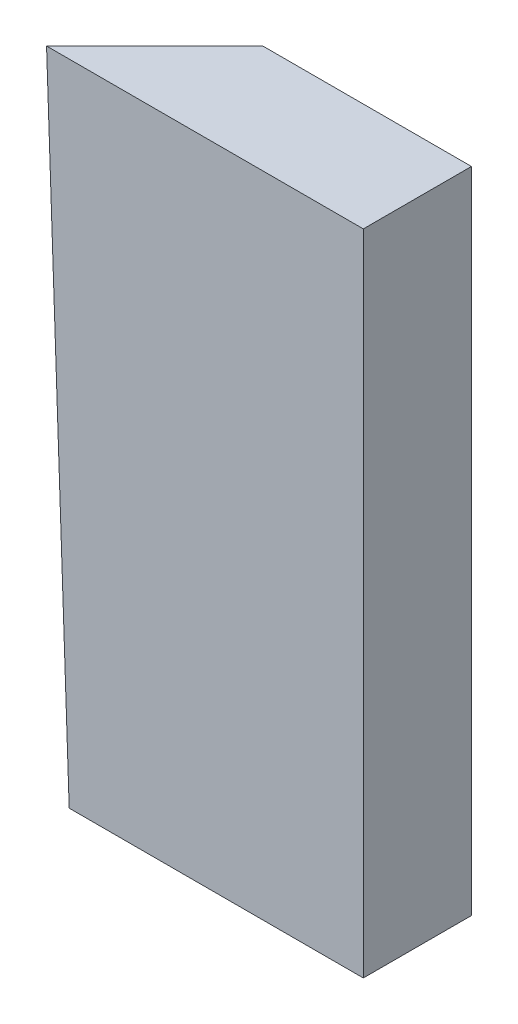
ISO-10303-21;
HEADER;
FILE_DESCRIPTION(('STEP AP214'),'2;1');
FILE_NAME('part.step','',(''),(''),'','','');
FILE_SCHEMA(('AUTOMOTIVE_DESIGN { 1 0 10303 214 1 1 1 1 }'));
ENDSEC;
DATA;
#1=APPLICATION_CONTEXT('core data for automotive mechanical design processes');
#2=APPLICATION_PROTOCOL_DEFINITION('international standard','automotive_design',2000,#1);
#3=PRODUCT_CONTEXT('',#1,'mechanical');
#4=PRODUCT('Part','Part','',(#3));
#5=PRODUCT_RELATED_PRODUCT_CATEGORY('part','',(#4));
#6=PRODUCT_DEFINITION_FORMATION('','',#4);
#7=PRODUCT_DEFINITION_CONTEXT('part definition',#1,'design');
#8=PRODUCT_DEFINITION('design','',#6,#7);
#9=PRODUCT_DEFINITION_SHAPE('','',#8);
#10=(LENGTH_UNIT() NAMED_UNIT(*) SI_UNIT(.MILLI.,.METRE.));
#11=(NAMED_UNIT(*) PLANE_ANGLE_UNIT() SI_UNIT($,.RADIAN.));
#12=(NAMED_UNIT(*) SI_UNIT($,.STERADIAN.) SOLID_ANGLE_UNIT());
#13=UNCERTAINTY_MEASURE_WITH_UNIT(LENGTH_MEASURE(1.E-05),#10,'distance_accuracy_value','');
#14=(GEOMETRIC_REPRESENTATION_CONTEXT(3) GLOBAL_UNCERTAINTY_ASSIGNED_CONTEXT((#13)) GLOBAL_UNIT_ASSIGNED_CONTEXT((#10,
#11,#12)) REPRESENTATION_CONTEXT('',''));
#15=CARTESIAN_POINT('',(0.,0.,0.));
#16=DIRECTION('',(0.,0.,1.));
#17=DIRECTION('',(1.,0.,0.));
#18=AXIS2_PLACEMENT_3D('',#15,#16,#17);
#19=CARTESIAN_POINT('',(0.,0.,0.));
#20=DIRECTION('',(0.,1.,0.));
#21=DIRECTION('',(0.,0.,1.));
#22=AXIS2_PLACEMENT_3D('',#19,#20,#21);
#23=PLANE('',#22);
#24=DIRECTION('',(-0.707106781186548,0.,0.707106781186547));
#25=VECTOR('',#24,1.);
#26=CARTESIAN_POINT('',(12.5,0.,-12.5));
#27=LINE('',#26,#25);
#28=CARTESIAN_POINT('',(12.5,0.,-12.5));
#29=VERTEX_POINT('',#28);
#30=CARTESIAN_POINT('',(0.,0.,0.));
#31=VERTEX_POINT('',#30);
#32=EDGE_CURVE('E167',#29,#31,#27,.T.);
#33=ORIENTED_EDGE('',*,*,#32,.F.);
#34=DIRECTION('',(-1.,0.,0.));
#35=VECTOR('',#34,1.);
#36=CARTESIAN_POINT('',(34.,0.,-12.5));
#37=LINE('',#36,#35);
#38=CARTESIAN_POINT('',(34.,0.,-12.5));
#39=VERTEX_POINT('',#38);
#40=EDGE_CURVE('E12',#39,#29,#37,.T.);
#41=ORIENTED_EDGE('',*,*,#40,.F.);
#42=DIRECTION('',(0.,0.,-1.));
#43=VECTOR('',#42,1.);
#44=CARTESIAN_POINT('',(34.,0.,0.));
#45=LINE('',#44,#43);
#46=CARTESIAN_POINT('',(34.,0.,0.));
#47=VERTEX_POINT('',#46);
#48=EDGE_CURVE('E61',#47,#39,#45,.T.);
#49=ORIENTED_EDGE('',*,*,#48,.F.);
#50=DIRECTION('',(1.,0.,0.));
#51=VECTOR('',#50,1.);
#52=CARTESIAN_POINT('',(0.,0.,0.));
#53=LINE('',#52,#51);
#54=EDGE_CURVE('E187',#31,#47,#53,.T.);
#55=ORIENTED_EDGE('',*,*,#54,.F.);
#56=EDGE_LOOP('',(#33,#41,#49,#55));
#57=FACE_BOUND('',#56,.T.);
#58=ADVANCED_FACE('F51',(#57),#23,.F.);
#59=CARTESIAN_POINT('',(0.,75.,0.));
#60=DIRECTION('',(0.,1.,0.));
#61=DIRECTION('',(0.,0.,1.));
#62=AXIS2_PLACEMENT_3D('',#59,#60,#61);
#63=PLANE('',#62);
#64=DIRECTION('',(1.,0.,0.));
#65=VECTOR('',#64,1.);
#66=CARTESIAN_POINT('',(-2.61905771188057,75.,0.));
#67=LINE('',#66,#65);
#68=CARTESIAN_POINT('',(-2.61905771188057,75.,0.));
#69=VERTEX_POINT('',#68);
#70=CARTESIAN_POINT('',(34.0009422881194,75.,0.));
#71=VERTEX_POINT('',#70);
#72=EDGE_CURVE('E155',#69,#71,#67,.T.);
#73=ORIENTED_EDGE('',*,*,#72,.T.);
#74=DIRECTION('',(0.,0.,-1.));
#75=VECTOR('',#74,1.);
#76=CARTESIAN_POINT('',(34.0009422881194,75.,0.));
#77=LINE('',#76,#75);
#78=CARTESIAN_POINT('',(34.0009422881194,75.,-12.5));
#79=VERTEX_POINT('',#78);
#80=EDGE_CURVE('E116',#71,#79,#77,.T.);
#81=ORIENTED_EDGE('',*,*,#80,.T.);
#82=DIRECTION('',(-1.,0.,0.));
#83=VECTOR('',#82,1.);
#84=CARTESIAN_POINT('',(34.0009422881194,75.,-12.5));
#85=LINE('',#84,#83);
#86=CARTESIAN_POINT('',(9.88094228811944,75.,-12.5));
#87=VERTEX_POINT('',#86);
#88=EDGE_CURVE('E96',#79,#87,#85,.T.);
#89=ORIENTED_EDGE('',*,*,#88,.T.);
#90=DIRECTION('',(-0.707106781186548,0.,0.707106781186547));
#91=VECTOR('',#90,1.);
#92=CARTESIAN_POINT('',(9.88094228811944,75.,-12.5));
#93=LINE('',#92,#91);
#94=EDGE_CURVE('E101',#87,#69,#93,.T.);
#95=ORIENTED_EDGE('',*,*,#94,.T.);
#96=EDGE_LOOP('',(#73,#81,#89,#95));
#97=FACE_BOUND('',#96,.T.);
#98=ADVANCED_FACE('F115',(#97),#63,.T.);
#99=CARTESIAN_POINT('',(0.,0.,0.));
#100=DIRECTION('',(-0.706891307583164,-0.024685188407827,-0.706891307583164));
#101=DIRECTION('',(-0.707106781186548,0.,0.707106781186547));
#102=AXIS2_PLACEMENT_3D('',#99,#100,#101);
#103=PLANE('',#102);
#104=DIRECTION('',(0.0348994967024942,-0.999390827019096,0.));
#105=VECTOR('',#104,1.);
#106=CARTESIAN_POINT('',(9.88094228811944,75.,-12.5));
#107=LINE('',#106,#105);
#108=EDGE_CURVE('E69',#87,#29,#107,.T.);
#109=ORIENTED_EDGE('',*,*,#108,.T.);
#110=ORIENTED_EDGE('',*,*,#32,.T.);
#111=DIRECTION('',(0.0348994967024942,-0.999390827019096,0.));
#112=VECTOR('',#111,1.);
#113=CARTESIAN_POINT('',(-2.61905771188057,75.,0.));
#114=LINE('',#113,#112);
#115=EDGE_CURVE('E100',#69,#31,#114,.T.);
#116=ORIENTED_EDGE('',*,*,#115,.F.);
#117=ORIENTED_EDGE('',*,*,#94,.F.);
#118=EDGE_LOOP('',(#109,#110,#116,#117));
#119=FACE_BOUND('',#118,.T.);
#120=ADVANCED_FACE('F105',(#119),#103,.T.);
#121=CARTESIAN_POINT('',(0.,0.,0.));
#122=DIRECTION('',(0.,0.,1.));
#123=DIRECTION('',(1.,0.,0.));
#124=AXIS2_PLACEMENT_3D('',#121,#122,#123);
#125=PLANE('',#124);
#126=ORIENTED_EDGE('',*,*,#115,.T.);
#127=ORIENTED_EDGE('',*,*,#54,.T.);
#128=DIRECTION('',(-1.25638415914733E-05,-0.999999999921075,0.));
#129=VECTOR('',#128,1.);
#130=CARTESIAN_POINT('',(34.0009422881194,75.,0.));
#131=LINE('',#130,#129);
#132=EDGE_CURVE('E192',#71,#47,#131,.T.);
#133=ORIENTED_EDGE('',*,*,#132,.F.);
#134=ORIENTED_EDGE('',*,*,#72,.F.);
#135=EDGE_LOOP('',(#126,#127,#133,#134));
#136=FACE_BOUND('',#135,.T.);
#137=ADVANCED_FACE('F211',(#136),#125,.T.);
#138=CARTESIAN_POINT('',(0.,0.,-12.5));
#139=DIRECTION('',(0.,0.,-1.));
#140=DIRECTION('',(-1.,0.,0.));
#141=AXIS2_PLACEMENT_3D('',#138,#139,#140);
#142=PLANE('',#141);
#143=DIRECTION('',(-1.25638415914733E-05,-0.999999999921075,0.));
#144=VECTOR('',#143,1.);
#145=CARTESIAN_POINT('',(34.0009422881194,75.,-12.5));
#146=LINE('',#145,#144);
#147=EDGE_CURVE('E194',#79,#39,#146,.T.);
#148=ORIENTED_EDGE('',*,*,#147,.T.);
#149=ORIENTED_EDGE('',*,*,#40,.T.);
#150=ORIENTED_EDGE('',*,*,#108,.F.);
#151=ORIENTED_EDGE('',*,*,#88,.F.);
#152=EDGE_LOOP('',(#148,#149,#150,#151));
#153=FACE_BOUND('',#152,.T.);
#154=ADVANCED_FACE('F94',(#153),#142,.T.);
#155=CARTESIAN_POINT('',(33.9999999946331,-0.000427170614076376,0.));
#156=DIRECTION('',(0.999999999921075,-1.25638415914733E-05,0.));
#157=DIRECTION('',(1.25638415914733E-05,0.999999999921075,0.));
#158=AXIS2_PLACEMENT_3D('',#155,#156,#157);
#159=PLANE('',#158);
#160=ORIENTED_EDGE('',*,*,#132,.T.);
#161=ORIENTED_EDGE('',*,*,#48,.T.);
#162=ORIENTED_EDGE('',*,*,#147,.F.);
#163=ORIENTED_EDGE('',*,*,#80,.F.);
#164=EDGE_LOOP('',(#160,#161,#162,#163));
#165=FACE_BOUND('',#164,.T.);
#166=ADVANCED_FACE('F245',(#165),#159,.T.);
#167=CLOSED_SHELL('',(#58,#98,#120,#137,#154,#166));
#168=MANIFOLD_SOLID_BREP('B2',#167);
#169=ADVANCED_BREP_SHAPE_REPRESENTATION('',(#18,#168),#14);
#170=SHAPE_DEFINITION_REPRESENTATION(#9,#169);
ENDSEC;
END-ISO-10303-21;
